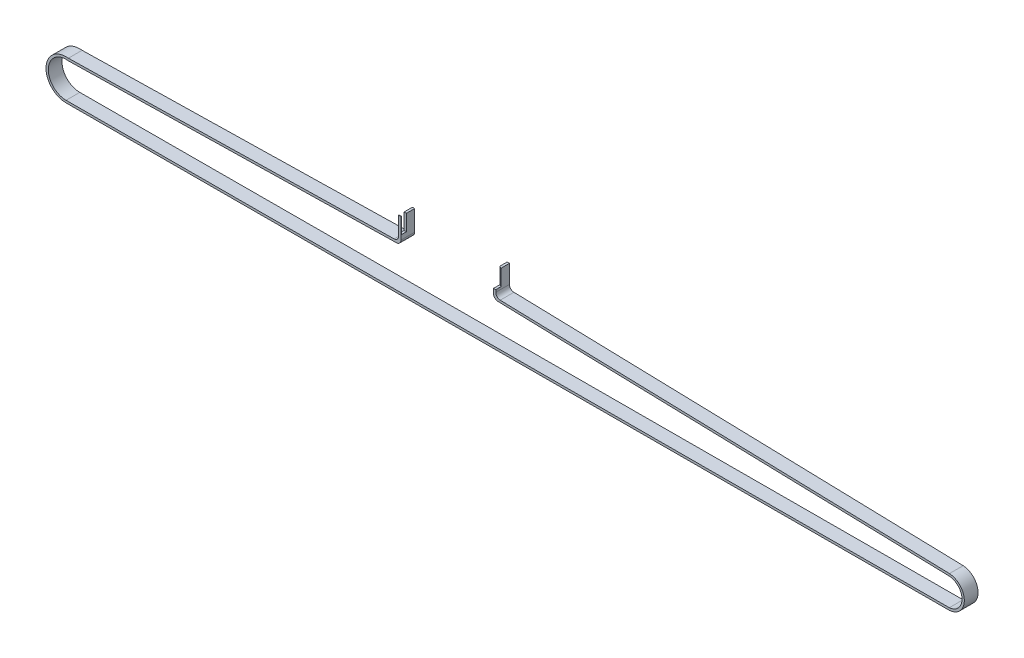
ISO-10303-21;
HEADER;
FILE_DESCRIPTION(('STEP AP214'),'2;1');
FILE_NAME('part.step','',(''),(''),'','','');
FILE_SCHEMA(('AUTOMOTIVE_DESIGN { 1 0 10303 214 1 1 1 1 }'));
ENDSEC;
DATA;
#1=APPLICATION_CONTEXT('core data for automotive mechanical design processes');
#2=APPLICATION_PROTOCOL_DEFINITION('international standard','automotive_design',2000,#1);
#3=PRODUCT_CONTEXT('',#1,'mechanical');
#4=PRODUCT('Part','Part','',(#3));
#5=PRODUCT_RELATED_PRODUCT_CATEGORY('part','',(#4));
#6=PRODUCT_DEFINITION_FORMATION('','',#4);
#7=PRODUCT_DEFINITION_CONTEXT('part definition',#1,'design');
#8=PRODUCT_DEFINITION('design','',#6,#7);
#9=PRODUCT_DEFINITION_SHAPE('','',#8);
#10=(LENGTH_UNIT() NAMED_UNIT(*) SI_UNIT(.MILLI.,.METRE.));
#11=(NAMED_UNIT(*) PLANE_ANGLE_UNIT() SI_UNIT($,.RADIAN.));
#12=(NAMED_UNIT(*) SI_UNIT($,.STERADIAN.) SOLID_ANGLE_UNIT());
#13=UNCERTAINTY_MEASURE_WITH_UNIT(LENGTH_MEASURE(1.E-05),#10,'distance_accuracy_value','');
#14=(GEOMETRIC_REPRESENTATION_CONTEXT(3) GLOBAL_UNCERTAINTY_ASSIGNED_CONTEXT((#13)) GLOBAL_UNIT_ASSIGNED_CONTEXT((#10,
#11,#12)) REPRESENTATION_CONTEXT('',''));
#15=CARTESIAN_POINT('',(0.,0.,0.));
#16=DIRECTION('',(0.,0.,1.));
#17=DIRECTION('',(1.,0.,0.));
#18=AXIS2_PLACEMENT_3D('',#15,#16,#17);
#19=CARTESIAN_POINT('',(-77.6123917073383,-109.1707684477,6.56356693467296));
#20=DIRECTION('',(0.,1.,0.));
#21=DIRECTION('',(0.,0.,1.));
#22=AXIS2_PLACEMENT_3D('',#19,#20,#21);
#23=PLANE('',#22);
#24=CARTESIAN_POINT('',(-76.3043909029961,-109.1707684477,2.20000000000011));
#25=DIRECTION('',(0.,1.,0.));
#26=DIRECTION('',(0.,0.,1.));
#27=AXIS2_PLACEMENT_3D('',#24,#25,#26);
#28=CIRCLE('',#27,2.);
#29=CARTESIAN_POINT('',(-76.6123917073383,-109.1707684477,4.17614156996025));
#30=VERTEX_POINT('',#29);
#31=CARTESIAN_POINT('',(-77.6123917073383,-109.1707684477,3.71298839910964));
#32=VERTEX_POINT('',#31);
#33=EDGE_CURVE('E19',#30,#32,#28,.F.);
#34=ORIENTED_EDGE('',*,*,#33,.F.);
#35=DIRECTION('',(0.,0.,-1.));
#36=VECTOR('',#35,1.);
#37=CARTESIAN_POINT('',(-76.6123917073383,-109.1707684477,6.56356693467296));
#38=LINE('',#37,#36);
#39=CARTESIAN_POINT('',(-76.6123917073383,-109.1707684477,0.563566934672959));
#40=VERTEX_POINT('',#39);
#41=EDGE_CURVE('E185',#40,#30,#38,.F.);
#42=ORIENTED_EDGE('',*,*,#41,.F.);
#43=DIRECTION('',(1.,0.,0.));
#44=VECTOR('',#43,1.);
#45=CARTESIAN_POINT('',(-77.6123917073383,-109.1707684477,0.563566934672959));
#46=LINE('',#45,#44);
#47=CARTESIAN_POINT('',(-77.4542112466602,-109.1707684477,0.563566934672959));
#48=VERTEX_POINT('',#47);
#49=EDGE_CURVE('E192',#40,#48,#46,.F.);
#50=ORIENTED_EDGE('',*,*,#49,.T.);
#51=CARTESIAN_POINT('',(-76.3043909029961,-109.1707684477,2.20000000000011));
#52=DIRECTION('',(0.,1.,0.));
#53=DIRECTION('',(0.,0.,1.));
#54=AXIS2_PLACEMENT_3D('',#51,#52,#53);
#55=CIRCLE('',#54,2.);
#56=CARTESIAN_POINT('',(-77.6123917073383,-109.1707684477,0.687011600890581));
#57=VERTEX_POINT('',#56);
#58=EDGE_CURVE('E206',#57,#48,#55,.F.);
#59=ORIENTED_EDGE('',*,*,#58,.F.);
#60=DIRECTION('',(0.,0.,-1.));
#61=VECTOR('',#60,1.);
#62=CARTESIAN_POINT('',(-77.6123917073383,-109.1707684477,6.56356693467296));
#63=LINE('',#62,#61);
#64=EDGE_CURVE('E188',#57,#32,#63,.F.);
#65=ORIENTED_EDGE('',*,*,#64,.T.);
#66=EDGE_LOOP('',(#34,#42,#50,#59,#65));
#67=FACE_BOUND('',#66,.T.);
#68=ADVANCED_FACE('F16',(#67),#23,.T.);
#69=CARTESIAN_POINT('',(-76.3043909029961,-116.170768447701,2.20000000000011));
#70=DIRECTION('',(0.,1.,0.));
#71=DIRECTION('',(0.,0.,1.));
#72=AXIS2_PLACEMENT_3D('',#69,#70,#71);
#73=CYLINDRICAL_SURFACE('',#72,2.);
#74=CARTESIAN_POINT('',(-76.3043909029961,-116.170768447701,2.20000000000011));
#75=DIRECTION('',(0.,1.,0.));
#76=DIRECTION('',(0.,0.,1.));
#77=AXIS2_PLACEMENT_3D('',#74,#75,#76);
#78=CIRCLE('',#77,2.);
#79=CARTESIAN_POINT('',(-76.6123917073383,-116.170768447701,4.17614156996025));
#80=VERTEX_POINT('',#79);
#81=CARTESIAN_POINT('',(-77.6123917073383,-116.170768447701,3.71298839910964));
#82=VERTEX_POINT('',#81);
#83=EDGE_CURVE('E191',#80,#82,#78,.F.);
#84=ORIENTED_EDGE('',*,*,#83,.F.);
#85=DIRECTION('',(0.,1.,0.));
#86=VECTOR('',#85,1.);
#87=CARTESIAN_POINT('',(-76.6123917073383,-120.096434525264,4.17614156996025));
#88=LINE('',#87,#86);
#89=EDGE_CURVE('E194',#30,#80,#88,.F.);
#90=ORIENTED_EDGE('',*,*,#89,.F.);
#91=ORIENTED_EDGE('',*,*,#33,.T.);
#92=DIRECTION('',(0.,1.,0.));
#93=VECTOR('',#92,1.);
#94=CARTESIAN_POINT('',(-77.6123917073383,-120.096434525264,3.71298839910964));
#95=LINE('',#94,#93);
#96=EDGE_CURVE('E267',#32,#82,#95,.F.);
#97=ORIENTED_EDGE('',*,*,#96,.T.);
#98=EDGE_LOOP('',(#84,#90,#91,#97));
#99=FACE_BOUND('',#98,.T.);
#100=ADVANCED_FACE('F195',(#99),#73,.T.);
#101=CARTESIAN_POINT('',(-76.3043909029961,-116.170768447701,2.20000000000011));
#102=DIRECTION('',(0.,1.,0.));
#103=DIRECTION('',(0.,0.,1.));
#104=AXIS2_PLACEMENT_3D('',#101,#102,#103);
#105=PLANE('',#104);
#106=DIRECTION('',(1.,0.,0.));
#107=VECTOR('',#106,1.);
#108=CARTESIAN_POINT('',(-76.3043909029961,-116.170768447701,6.56356693467296));
#109=LINE('',#108,#107);
#110=CARTESIAN_POINT('',(-77.6123917073383,-116.170768447701,6.56356693467296));
#111=VERTEX_POINT('',#110);
#112=CARTESIAN_POINT('',(-76.6123917073383,-116.170768447701,6.56356693467296));
#113=VERTEX_POINT('',#112);
#114=EDGE_CURVE('E269',#111,#113,#109,.T.);
#115=ORIENTED_EDGE('',*,*,#114,.T.);
#116=DIRECTION('',(0.,0.,-1.));
#117=VECTOR('',#116,1.);
#118=CARTESIAN_POINT('',(-76.6123917073383,-116.170768447701,6.56356693467296));
#119=LINE('',#118,#117);
#120=EDGE_CURVE('E200',#80,#113,#119,.F.);
#121=ORIENTED_EDGE('',*,*,#120,.F.);
#122=ORIENTED_EDGE('',*,*,#83,.T.);
#123=DIRECTION('',(0.,0.,-1.));
#124=VECTOR('',#123,1.);
#125=CARTESIAN_POINT('',(-77.6123917073383,-116.170768447701,6.56356693467296));
#126=LINE('',#125,#124);
#127=EDGE_CURVE('E237',#82,#111,#126,.F.);
#128=ORIENTED_EDGE('',*,*,#127,.T.);
#129=EDGE_LOOP('',(#115,#121,#122,#128));
#130=FACE_BOUND('',#129,.T.);
#131=ADVANCED_FACE('F354',(#130),#105,.T.);
#132=CARTESIAN_POINT('',(-118.921768143894,-116.170768447701,2.20000000000011));
#133=DIRECTION('',(0.,1.,0.));
#134=DIRECTION('',(0.,0.,1.));
#135=AXIS2_PLACEMENT_3D('',#132,#133,#134);
#136=CYLINDRICAL_SURFACE('',#135,4.17693228606131);
#137=CARTESIAN_POINT('',(-118.921768143894,-116.170768447701,2.20000000000011));
#138=DIRECTION('',(0.,1.,0.));
#139=DIRECTION('',(0.,0.,1.));
#140=AXIS2_PLACEMENT_3D('',#137,#138,#139);
#141=CIRCLE('',#140,4.17693228606131);
#142=CARTESIAN_POINT('',(-119.111696821927,-116.170768447701,6.37261194212965));
#143=VERTEX_POINT('',#142);
#144=CARTESIAN_POINT('',(-118.111696821927,-116.170768447701,6.2976270908501));
#145=VERTEX_POINT('',#144);
#146=EDGE_CURVE('E272',#143,#145,#141,.T.);
#147=ORIENTED_EDGE('',*,*,#146,.F.);
#148=DIRECTION('',(0.,1.,0.));
#149=VECTOR('',#148,1.);
#150=CARTESIAN_POINT('',(-119.111696821927,-120.096434525272,6.37261194212965));
#151=LINE('',#150,#149);
#152=CARTESIAN_POINT('',(-119.111696821927,-109.1707684477,6.37261194212965));
#153=VERTEX_POINT('',#152);
#154=EDGE_CURVE('E242',#153,#143,#151,.F.);
#155=ORIENTED_EDGE('',*,*,#154,.F.);
#156=CARTESIAN_POINT('',(-118.921768143894,-109.1707684477,2.20000000000011));
#157=DIRECTION('',(0.,1.,0.));
#158=DIRECTION('',(0.,0.,1.));
#159=AXIS2_PLACEMENT_3D('',#156,#157,#158);
#160=CIRCLE('',#159,4.17693228606131);
#161=CARTESIAN_POINT('',(-118.111696821927,-109.1707684477,6.2976270908501));
#162=VERTEX_POINT('',#161);
#163=EDGE_CURVE('E261',#162,#153,#160,.F.);
#164=ORIENTED_EDGE('',*,*,#163,.F.);
#165=DIRECTION('',(0.,1.,0.));
#166=VECTOR('',#165,1.);
#167=CARTESIAN_POINT('',(-118.111696821927,-120.096434525272,6.2976270908501));
#168=LINE('',#167,#166);
#169=EDGE_CURVE('E256',#162,#145,#168,.F.);
#170=ORIENTED_EDGE('',*,*,#169,.T.);
#171=EDGE_LOOP('',(#147,#155,#164,#170));
#172=FACE_BOUND('',#171,.T.);
#173=ADVANCED_FACE('F743',(#172),#136,.F.);
#174=CARTESIAN_POINT('',(-118.921768143894,-116.170768447701,2.20000000000011));
#175=DIRECTION('',(0.,1.,0.));
#176=DIRECTION('',(0.,0.,1.));
#177=AXIS2_PLACEMENT_3D('',#174,#175,#176);
#178=PLANE('',#177);
#179=DIRECTION('',(0.,0.,1.));
#180=VECTOR('',#179,1.);
#181=CARTESIAN_POINT('',(-119.111696821927,-116.170768447701,6.56356693467296));
#182=LINE('',#181,#180);
#183=CARTESIAN_POINT('',(-119.111696821927,-116.170768447701,4.1909613500169));
#184=VERTEX_POINT('',#183);
#185=EDGE_CURVE('E245',#143,#184,#182,.F.);
#186=ORIENTED_EDGE('',*,*,#185,.F.);
#187=ORIENTED_EDGE('',*,*,#146,.T.);
#188=DIRECTION('',(0.,0.,1.));
#189=VECTOR('',#188,1.);
#190=CARTESIAN_POINT('',(-118.111696821927,-116.170768447701,6.56356693467296));
#191=LINE('',#190,#189);
#192=CARTESIAN_POINT('',(-118.111696821927,-116.170768447701,4.02860177549044));
#193=VERTEX_POINT('',#192);
#194=EDGE_CURVE('E258',#145,#193,#191,.F.);
#195=ORIENTED_EDGE('',*,*,#194,.T.);
#196=CARTESIAN_POINT('',(-118.921768143894,-116.170768447701,2.20000000000011));
#197=DIRECTION('',(0.,1.,0.));
#198=DIRECTION('',(0.,0.,1.));
#199=AXIS2_PLACEMENT_3D('',#196,#197,#198);
#200=CIRCLE('',#199,2.);
#201=EDGE_CURVE('E348',#184,#193,#200,.T.);
#202=ORIENTED_EDGE('',*,*,#201,.F.);
#203=EDGE_LOOP('',(#186,#187,#195,#202));
#204=FACE_BOUND('',#203,.T.);
#205=ADVANCED_FACE('F734',(#204),#178,.T.);
#206=CARTESIAN_POINT('',(-118.921768143894,-116.170768447701,2.20000000000011));
#207=DIRECTION('',(0.,1.,0.));
#208=DIRECTION('',(0.,0.,1.));
#209=AXIS2_PLACEMENT_3D('',#206,#207,#208);
#210=CYLINDRICAL_SURFACE('',#209,2.);
#211=CARTESIAN_POINT('',(-118.921768143894,-109.1707684477,2.20000000000011));
#212=DIRECTION('',(0.,1.,0.));
#213=DIRECTION('',(0.,0.,1.));
#214=AXIS2_PLACEMENT_3D('',#211,#212,#213);
#215=CIRCLE('',#214,2.);
#216=CARTESIAN_POINT('',(-119.111696821927,-109.1707684477,4.1909613500169));
#217=VERTEX_POINT('',#216);
#218=CARTESIAN_POINT('',(-118.111696821927,-109.1707684477,4.02860177549044));
#219=VERTEX_POINT('',#218);
#220=EDGE_CURVE('E251',#217,#219,#215,.T.);
#221=ORIENTED_EDGE('',*,*,#220,.F.);
#222=DIRECTION('',(0.,1.,0.));
#223=VECTOR('',#222,1.);
#224=CARTESIAN_POINT('',(-119.111696821927,-120.096434525272,4.1909613500169));
#225=LINE('',#224,#223);
#226=EDGE_CURVE('E223',#184,#217,#225,.T.);
#227=ORIENTED_EDGE('',*,*,#226,.F.);
#228=ORIENTED_EDGE('',*,*,#201,.T.);
#229=DIRECTION('',(0.,1.,0.));
#230=VECTOR('',#229,1.);
#231=CARTESIAN_POINT('',(-118.111696821927,-120.096434525272,4.02860177549044));
#232=LINE('',#231,#230);
#233=EDGE_CURVE('E230',#193,#219,#232,.T.);
#234=ORIENTED_EDGE('',*,*,#233,.T.);
#235=EDGE_LOOP('',(#221,#227,#228,#234));
#236=FACE_BOUND('',#235,.T.);
#237=ADVANCED_FACE('F725',(#236),#210,.T.);
#238=CARTESIAN_POINT('',(-119.111696821927,-109.1707684477,6.56356693467296));
#239=DIRECTION('',(0.,1.,0.));
#240=DIRECTION('',(0.,0.,1.));
#241=AXIS2_PLACEMENT_3D('',#238,#239,#240);
#242=PLANE('',#241);
#243=DIRECTION('',(0.,0.,1.));
#244=VECTOR('',#243,1.);
#245=CARTESIAN_POINT('',(-118.111696821927,-109.1707684477,6.56356693467296));
#246=LINE('',#245,#244);
#247=CARTESIAN_POINT('',(-118.111696821927,-109.1707684477,0.563566934672959));
#248=VERTEX_POINT('',#247);
#249=EDGE_CURVE('E226',#219,#248,#246,.F.);
#250=ORIENTED_EDGE('',*,*,#249,.T.);
#251=DIRECTION('',(1.,0.,0.));
#252=VECTOR('',#251,1.);
#253=CARTESIAN_POINT('',(-119.111696821927,-109.1707684477,0.563566934672959));
#254=LINE('',#253,#252);
#255=CARTESIAN_POINT('',(-119.111696821927,-109.1707684477,0.563566934672959));
#256=VERTEX_POINT('',#255);
#257=EDGE_CURVE('E201',#248,#256,#254,.F.);
#258=ORIENTED_EDGE('',*,*,#257,.T.);
#259=DIRECTION('',(0.,0.,1.));
#260=VECTOR('',#259,1.);
#261=CARTESIAN_POINT('',(-119.111696821927,-109.1707684477,6.56356693467296));
#262=LINE('',#261,#260);
#263=EDGE_CURVE('E219',#217,#256,#262,.F.);
#264=ORIENTED_EDGE('',*,*,#263,.F.);
#265=ORIENTED_EDGE('',*,*,#220,.T.);
#266=EDGE_LOOP('',(#250,#258,#264,#265));
#267=FACE_BOUND('',#266,.T.);
#268=ADVANCED_FACE('F511',(#267),#242,.T.);
#269=CARTESIAN_POINT('',(-76.6123917073383,-120.096434525264,6.56356693467296));
#270=DIRECTION('',(1.,0.,0.));
#271=DIRECTION('',(0.,0.,-1.));
#272=AXIS2_PLACEMENT_3D('',#269,#270,#271);
#273=PLANE('',#272);
#274=DIRECTION('',(0.,1.,0.));
#275=VECTOR('',#274,1.);
#276=CARTESIAN_POINT('',(-76.6123917073383,-130.657156953866,0.563566934672959));
#277=LINE('',#276,#275);
#278=CARTESIAN_POINT('',(-76.6123917073383,-117.176487603258,0.563566934672959));
#279=VERTEX_POINT('',#278);
#280=EDGE_CURVE('E205',#279,#40,#277,.T.);
#281=ORIENTED_EDGE('',*,*,#280,.T.);
#282=ORIENTED_EDGE('',*,*,#41,.T.);
#283=ORIENTED_EDGE('',*,*,#89,.T.);
#284=ORIENTED_EDGE('',*,*,#120,.T.);
#285=DIRECTION('',(0.,1.,0.));
#286=VECTOR('',#285,1.);
#287=CARTESIAN_POINT('',(-76.6123917073383,-120.096434525264,6.56356693467296));
#288=LINE('',#287,#286);
#289=CARTESIAN_POINT('',(-76.6123917073383,-117.176487603258,6.56356693467296));
#290=VERTEX_POINT('',#289);
#291=EDGE_CURVE('E207',#113,#290,#288,.F.);
#292=ORIENTED_EDGE('',*,*,#291,.T.);
#293=DIRECTION('',(0.,0.,1.));
#294=VECTOR('',#293,1.);
#295=CARTESIAN_POINT('',(-76.6123917073383,-117.176487603258,6.56356693467296));
#296=LINE('',#295,#294);
#297=EDGE_CURVE('E391',#290,#279,#296,.F.);
#298=ORIENTED_EDGE('',*,*,#297,.T.);
#299=EDGE_LOOP('',(#281,#282,#283,#284,#292,#298));
#300=FACE_BOUND('',#299,.T.);
#301=ADVANCED_FACE('F203',(#300),#273,.T.);
#302=CARTESIAN_POINT('',(-76.3043909029961,-116.170768447701,2.20000000000011));
#303=DIRECTION('',(0.,1.,0.));
#304=DIRECTION('',(0.,0.,1.));
#305=AXIS2_PLACEMENT_3D('',#302,#303,#304);
#306=CYLINDRICAL_SURFACE('',#305,2.);
#307=DIRECTION('',(0.,1.,0.));
#308=VECTOR('',#307,1.);
#309=CARTESIAN_POINT('',(-77.4542112466602,-130.657156953866,0.563566934672959));
#310=LINE('',#309,#308);
#311=CARTESIAN_POINT('',(-77.4542112466602,-116.170768447701,0.563566934672959));
#312=VERTEX_POINT('',#311);
#313=EDGE_CURVE('E365',#48,#312,#310,.F.);
#314=ORIENTED_EDGE('',*,*,#313,.T.);
#315=CARTESIAN_POINT('',(-76.3043909029961,-116.170768447701,2.20000000000011));
#316=DIRECTION('',(0.,1.,0.));
#317=DIRECTION('',(0.,0.,1.));
#318=AXIS2_PLACEMENT_3D('',#315,#316,#317);
#319=CIRCLE('',#318,2.);
#320=CARTESIAN_POINT('',(-77.6123917073383,-116.170768447701,0.687011600890581));
#321=VERTEX_POINT('',#320);
#322=EDGE_CURVE('E210',#321,#312,#319,.F.);
#323=ORIENTED_EDGE('',*,*,#322,.F.);
#324=DIRECTION('',(0.,1.,0.));
#325=VECTOR('',#324,1.);
#326=CARTESIAN_POINT('',(-77.6123917073383,-120.096434525264,0.687011600890582));
#327=LINE('',#326,#325);
#328=EDGE_CURVE('E264',#321,#57,#327,.T.);
#329=ORIENTED_EDGE('',*,*,#328,.T.);
#330=ORIENTED_EDGE('',*,*,#58,.T.);
#331=EDGE_LOOP('',(#314,#323,#329,#330));
#332=FACE_BOUND('',#331,.T.);
#333=ADVANCED_FACE('F502',(#332),#306,.T.);
#334=CARTESIAN_POINT('',(-76.3043909029961,-116.170768447701,2.20000000000011));
#335=DIRECTION('',(0.,1.,0.));
#336=DIRECTION('',(0.,0.,1.));
#337=AXIS2_PLACEMENT_3D('',#334,#335,#336);
#338=PLANE('',#337);
#339=ORIENTED_EDGE('',*,*,#322,.T.);
#340=DIRECTION('',(1.,0.,0.));
#341=VECTOR('',#340,1.);
#342=CARTESIAN_POINT('',(-264.648815476265,-116.170768447701,0.563566934672959));
#343=LINE('',#342,#341);
#344=CARTESIAN_POINT('',(-77.6123917073383,-116.170768447701,0.563566934672959));
#345=VERTEX_POINT('',#344);
#346=EDGE_CURVE('E320',#312,#345,#343,.F.);
#347=ORIENTED_EDGE('',*,*,#346,.T.);
#348=DIRECTION('',(0.,0.,-1.));
#349=VECTOR('',#348,1.);
#350=CARTESIAN_POINT('',(-77.6123917073383,-116.170768447701,6.56356693467296));
#351=LINE('',#350,#349);
#352=EDGE_CURVE('E233',#345,#321,#351,.F.);
#353=ORIENTED_EDGE('',*,*,#352,.T.);
#354=EDGE_LOOP('',(#339,#347,#353));
#355=FACE_BOUND('',#354,.T.);
#356=ADVANCED_FACE('F370',(#355),#338,.T.);
#357=CARTESIAN_POINT('',(-77.6123917073383,-120.096434525264,6.56356693467296));
#358=DIRECTION('',(1.,0.,0.));
#359=DIRECTION('',(0.,0.,-1.));
#360=AXIS2_PLACEMENT_3D('',#357,#358,#359);
#361=PLANE('',#360);
#362=DIRECTION('',(0.,1.,0.));
#363=VECTOR('',#362,1.);
#364=CARTESIAN_POINT('',(-77.6123917073383,-130.657156953866,0.563566934672959));
#365=LINE('',#364,#363);
#366=CARTESIAN_POINT('',(-77.6123917073383,-118.149803243927,0.563566934672959));
#367=VERTEX_POINT('',#366);
#368=EDGE_CURVE('E341',#345,#367,#365,.F.);
#369=ORIENTED_EDGE('',*,*,#368,.T.);
#370=DIRECTION('',(0.,0.,-1.));
#371=VECTOR('',#370,1.);
#372=CARTESIAN_POINT('',(-77.6123917073383,-118.149803243927,6.56356693467296));
#373=LINE('',#372,#371);
#374=CARTESIAN_POINT('',(-77.6123917073383,-118.149803243927,6.56356693467296));
#375=VERTEX_POINT('',#374);
#376=EDGE_CURVE('E236',#375,#367,#373,.T.);
#377=ORIENTED_EDGE('',*,*,#376,.F.);
#378=DIRECTION('',(0.,1.,0.));
#379=VECTOR('',#378,1.);
#380=CARTESIAN_POINT('',(-77.6123917073383,-130.657156953866,6.56356693467296));
#381=LINE('',#380,#379);
#382=EDGE_CURVE('E315',#111,#375,#381,.F.);
#383=ORIENTED_EDGE('',*,*,#382,.F.);
#384=ORIENTED_EDGE('',*,*,#127,.F.);
#385=ORIENTED_EDGE('',*,*,#96,.F.);
#386=ORIENTED_EDGE('',*,*,#64,.F.);
#387=ORIENTED_EDGE('',*,*,#328,.F.);
#388=ORIENTED_EDGE('',*,*,#352,.F.);
#389=EDGE_LOOP('',(#369,#377,#383,#384,#385,#386,#387,#388));
#390=FACE_BOUND('',#389,.T.);
#391=ADVANCED_FACE('F357',(#390),#361,.F.);
#392=CARTESIAN_POINT('',(-75.6123917073383,-118.149803243927,6.56356693467296));
#393=DIRECTION('',(0.,0.,-1.));
#394=DIRECTION('',(-1.,0.,0.));
#395=AXIS2_PLACEMENT_3D('',#392,#393,#394);
#396=CYLINDRICAL_SURFACE('',#395,2.);
#397=CARTESIAN_POINT('',(-75.6123917073383,-118.149803243927,0.563566934672959));
#398=DIRECTION('',(0.,0.,-1.));
#399=DIRECTION('',(-1.,0.,0.));
#400=AXIS2_PLACEMENT_3D('',#397,#398,#399);
#401=CIRCLE('',#400,2.);
#402=CARTESIAN_POINT('',(-75.666472220668,-120.149071934743,0.563566934672958));
#403=VERTEX_POINT('',#402);
#404=EDGE_CURVE('E339',#367,#403,#401,.F.);
#405=ORIENTED_EDGE('',*,*,#404,.T.);
#406=DIRECTION('',(0.,0.,1.));
#407=VECTOR('',#406,1.);
#408=CARTESIAN_POINT('',(-75.666472220668,-120.149071934743,6.56356693467296));
#409=LINE('',#408,#407);
#410=CARTESIAN_POINT('',(-75.666472220668,-120.149071934743,6.56356693467296));
#411=VERTEX_POINT('',#410);
#412=EDGE_CURVE('E423',#403,#411,#409,.T.);
#413=ORIENTED_EDGE('',*,*,#412,.T.);
#414=CARTESIAN_POINT('',(-75.6123917073383,-118.149803243927,6.56356693467296));
#415=DIRECTION('',(0.,0.,-1.));
#416=DIRECTION('',(-1.,0.,0.));
#417=AXIS2_PLACEMENT_3D('',#414,#415,#416);
#418=CIRCLE('',#417,2.);
#419=EDGE_CURVE('E312',#375,#411,#418,.F.);
#420=ORIENTED_EDGE('',*,*,#419,.F.);
#421=ORIENTED_EDGE('',*,*,#376,.T.);
#422=EDGE_LOOP('',(#405,#413,#420,#421));
#423=FACE_BOUND('',#422,.T.);
#424=ADVANCED_FACE('F428',(#423),#396,.T.);
#425=CARTESIAN_POINT('',(121.836852943332,-125.491566046838,6.56356693467296));
#426=DIRECTION('',(0.0270402566648223,0.99963434540811,0.));
#427=DIRECTION('',(-0.99963434540811,0.0270402566648223,0.));
#428=AXIS2_PLACEMENT_3D('',#425,#426,#427);
#429=PLANE('',#428);
#430=ORIENTED_EDGE('',*,*,#412,.F.);
#431=DIRECTION('',(0.99963434540811,-0.0270402566648222,0.));
#432=VECTOR('',#431,1.);
#433=CARTESIAN_POINT('',(-75.666472220668,-120.149071934743,0.563566934672959));
#434=LINE('',#433,#432);
#435=CARTESIAN_POINT('',(121.836852943332,-125.491566046838,0.563566934672959));
#436=VERTEX_POINT('',#435);
#437=EDGE_CURVE('E338',#403,#436,#434,.T.);
#438=ORIENTED_EDGE('',*,*,#437,.T.);
#439=DIRECTION('',(0.,0.,-1.));
#440=VECTOR('',#439,1.);
#441=CARTESIAN_POINT('',(121.836852943332,-125.491566046838,6.56356693467296));
#442=LINE('',#441,#440);
#443=CARTESIAN_POINT('',(121.836852943332,-125.491566046838,6.56356693467296));
#444=VERTEX_POINT('',#443);
#445=EDGE_CURVE('E422',#436,#444,#442,.F.);
#446=ORIENTED_EDGE('',*,*,#445,.T.);
#447=DIRECTION('',(0.99963434540811,-0.0270402566648222,0.));
#448=VECTOR('',#447,1.);
#449=CARTESIAN_POINT('',(-75.666472220668,-120.149071934743,6.56356693467296));
#450=LINE('',#449,#448);
#451=EDGE_CURVE('E311',#411,#444,#450,.T.);
#452=ORIENTED_EDGE('',*,*,#451,.F.);
#453=EDGE_LOOP('',(#430,#438,#446,#452));
#454=FACE_BOUND('',#453,.T.);
#455=ADVANCED_FACE('F571',(#454),#429,.F.);
#456=CARTESIAN_POINT('',(121.394517857936,-131.470824001945,6.56356693467296));
#457=DIRECTION('',(0.,0.,-1.));
#458=DIRECTION('',(-1.,0.,0.));
#459=AXIS2_PLACEMENT_3D('',#456,#457,#458);
#460=CYLINDRICAL_SURFACE('',#459,5.99559721975081);
#461=DIRECTION('',(0.,0.,1.));
#462=VECTOR('',#461,1.);
#463=CARTESIAN_POINT('',(121.825156451343,-137.450935741984,6.56356693467296));
#464=LINE('',#463,#462);
#465=CARTESIAN_POINT('',(121.825156451343,-137.450935741984,0.563566934672958));
#466=VERTEX_POINT('',#465);
#467=CARTESIAN_POINT('',(121.825156451343,-137.450935741984,6.56356693467296));
#468=VERTEX_POINT('',#467);
#469=EDGE_CURVE('E420',#466,#468,#464,.T.);
#470=ORIENTED_EDGE('',*,*,#469,.T.);
#471=CARTESIAN_POINT('',(121.394517857936,-131.470824001945,6.56356693467296));
#472=DIRECTION('',(0.,0.,-1.));
#473=DIRECTION('',(-1.,0.,0.));
#474=AXIS2_PLACEMENT_3D('',#471,#472,#473);
#475=CIRCLE('',#474,5.99559721975081);
#476=EDGE_CURVE('E308',#444,#468,#475,.T.);
#477=ORIENTED_EDGE('',*,*,#476,.F.);
#478=ORIENTED_EDGE('',*,*,#445,.F.);
#479=CARTESIAN_POINT('',(121.394517857936,-131.470824001945,0.563566934672959));
#480=DIRECTION('',(0.,0.,-1.));
#481=DIRECTION('',(-1.,0.,0.));
#482=AXIS2_PLACEMENT_3D('',#479,#480,#481);
#483=CIRCLE('',#482,5.99559721975081);
#484=EDGE_CURVE('E336',#436,#466,#483,.T.);
#485=ORIENTED_EDGE('',*,*,#484,.T.);
#486=EDGE_LOOP('',(#470,#477,#478,#485));
#487=FACE_BOUND('',#486,.T.);
#488=ADVANCED_FACE('F568',(#487),#460,.F.);
#489=CARTESIAN_POINT('',(-264.629528335664,-138.412080698056,6.56356693467296));
#490=DIRECTION('',(0.00248707551312212,-0.999996907222913,0.));
#491=DIRECTION('',(0.999996907222913,0.00248707551312212,0.));
#492=AXIS2_PLACEMENT_3D('',#489,#490,#491);
#493=PLANE('',#492);
#494=DIRECTION('',(0.,0.,-1.));
#495=VECTOR('',#494,1.);
#496=CARTESIAN_POINT('',(-264.629528335664,-138.412080698056,6.56356693467296));
#497=LINE('',#496,#495);
#498=CARTESIAN_POINT('',(-264.629528335664,-138.412080698056,0.563566934672959));
#499=VERTEX_POINT('',#498);
#500=CARTESIAN_POINT('',(-264.629528335664,-138.412080698056,6.56356693467296));
#501=VERTEX_POINT('',#500);
#502=EDGE_CURVE('E417',#499,#501,#497,.F.);
#503=ORIENTED_EDGE('',*,*,#502,.T.);
#504=DIRECTION('',(-0.999996907222913,-0.00248707551312205,0.));
#505=VECTOR('',#504,1.);
#506=CARTESIAN_POINT('',(121.825156451343,-137.450935741984,6.56356693467296));
#507=LINE('',#506,#505);
#508=EDGE_CURVE('E307',#468,#501,#507,.T.);
#509=ORIENTED_EDGE('',*,*,#508,.F.);
#510=ORIENTED_EDGE('',*,*,#469,.F.);
#511=DIRECTION('',(-0.999996907222913,-0.00248707551312205,0.));
#512=VECTOR('',#511,1.);
#513=CARTESIAN_POINT('',(121.825156451343,-137.450935741984,0.563566934672959));
#514=LINE('',#513,#512);
#515=EDGE_CURVE('E335',#466,#499,#514,.T.);
#516=ORIENTED_EDGE('',*,*,#515,.T.);
#517=EDGE_LOOP('',(#503,#509,#510,#516));
#518=FACE_BOUND('',#517,.T.);
#519=ADVANCED_FACE('F465',(#518),#493,.F.);
#520=CARTESIAN_POINT('',(-264.648815476265,-130.657156953866,6.56356693467296));
#521=DIRECTION('',(0.,0.,-1.));
#522=DIRECTION('',(-1.,0.,0.));
#523=AXIS2_PLACEMENT_3D('',#520,#521,#522);
#524=CYLINDRICAL_SURFACE('',#523,7.75494772851443);
#525=CARTESIAN_POINT('',(-264.648815476265,-130.657156953866,6.56356693467296));
#526=DIRECTION('',(0.,0.,-1.));
#527=DIRECTION('',(-1.,0.,0.));
#528=AXIS2_PLACEMENT_3D('',#525,#526,#527);
#529=CIRCLE('',#528,7.75494772851443);
#530=CARTESIAN_POINT('',(-263.662284962799,-122.965214948235,6.56356693467296));
#531=VERTEX_POINT('',#530);
#532=EDGE_CURVE('E304',#501,#531,#529,.T.);
#533=ORIENTED_EDGE('',*,*,#532,.F.);
#534=ORIENTED_EDGE('',*,*,#502,.F.);
#535=CARTESIAN_POINT('',(-264.648815476265,-130.657156953866,0.563566934672959));
#536=DIRECTION('',(0.,0.,-1.));
#537=DIRECTION('',(-1.,0.,0.));
#538=AXIS2_PLACEMENT_3D('',#535,#536,#537);
#539=CIRCLE('',#538,7.75494772851443);
#540=CARTESIAN_POINT('',(-263.662284962799,-122.965214948235,0.563566934672958));
#541=VERTEX_POINT('',#540);
#542=EDGE_CURVE('E333',#499,#541,#539,.T.);
#543=ORIENTED_EDGE('',*,*,#542,.T.);
#544=DIRECTION('',(0.,0.,1.));
#545=VECTOR('',#544,1.);
#546=CARTESIAN_POINT('',(-263.662284962799,-122.965214948235,6.56356693467296));
#547=LINE('',#546,#545);
#548=EDGE_CURVE('E415',#541,#531,#547,.T.);
#549=ORIENTED_EDGE('',*,*,#548,.T.);
#550=EDGE_LOOP('',(#533,#534,#543,#549));
#551=FACE_BOUND('',#550,.T.);
#552=ADVANCED_FACE('F470',(#551),#524,.F.);
#553=CARTESIAN_POINT('',(-263.662284962799,-122.965214948235,6.56356693467296));
#554=DIRECTION('',(-0.0197060238129421,0.999805817459312,0.));
#555=DIRECTION('',(-0.999805817459312,-0.0197060238129421,0.));
#556=AXIS2_PLACEMENT_3D('',#553,#554,#555);
#557=PLANE('',#556);
#558=DIRECTION('',(0.,0.,-1.));
#559=VECTOR('',#558,1.);
#560=CARTESIAN_POINT('',(-120.072284774301,-120.135077421925,6.56356693467296));
#561=LINE('',#560,#559);
#562=CARTESIAN_POINT('',(-120.072284774301,-120.135077421925,6.56356693467296));
#563=VERTEX_POINT('',#562);
#564=CARTESIAN_POINT('',(-120.072284774301,-120.135077421925,0.563566934672959));
#565=VERTEX_POINT('',#564);
#566=EDGE_CURVE('E263',#563,#565,#561,.T.);
#567=ORIENTED_EDGE('',*,*,#566,.F.);
#568=DIRECTION('',(0.999805817459312,0.0197060238129421,0.));
#569=VECTOR('',#568,1.);
#570=CARTESIAN_POINT('',(-263.662284962799,-122.965214948235,6.56356693467296));
#571=LINE('',#570,#569);
#572=EDGE_CURVE('E303',#531,#563,#571,.T.);
#573=ORIENTED_EDGE('',*,*,#572,.F.);
#574=ORIENTED_EDGE('',*,*,#548,.F.);
#575=DIRECTION('',(0.999805817459312,0.0197060238129421,0.));
#576=VECTOR('',#575,1.);
#577=CARTESIAN_POINT('',(-263.662284962799,-122.965214948235,0.563566934672959));
#578=LINE('',#577,#576);
#579=EDGE_CURVE('E332',#541,#565,#578,.T.);
#580=ORIENTED_EDGE('',*,*,#579,.T.);
#581=EDGE_LOOP('',(#567,#573,#574,#580));
#582=FACE_BOUND('',#581,.T.);
#583=ADVANCED_FACE('F559',(#582),#557,.F.);
#584=CARTESIAN_POINT('',(-120.111696821927,-118.135465787006,6.56356693467296));
#585=DIRECTION('',(0.,0.,-1.));
#586=DIRECTION('',(-1.,0.,0.));
#587=AXIS2_PLACEMENT_3D('',#584,#585,#586);
#588=CYLINDRICAL_SURFACE('',#587,2.);
#589=CARTESIAN_POINT('',(-120.111696821927,-118.135465787006,0.563566934672959));
#590=DIRECTION('',(0.,0.,-1.));
#591=DIRECTION('',(-1.,0.,0.));
#592=AXIS2_PLACEMENT_3D('',#589,#590,#591);
#593=CIRCLE('',#592,2.);
#594=CARTESIAN_POINT('',(-118.111696821927,-118.135465787006,0.563566934672959));
#595=VERTEX_POINT('',#594);
#596=EDGE_CURVE('E329',#565,#595,#593,.F.);
#597=ORIENTED_EDGE('',*,*,#596,.T.);
#598=DIRECTION('',(0.,0.,1.));
#599=VECTOR('',#598,1.);
#600=CARTESIAN_POINT('',(-118.111696821927,-118.135465787006,6.56356693467296));
#601=LINE('',#600,#599);
#602=CARTESIAN_POINT('',(-118.111696821927,-118.135465787006,6.56356693467296));
#603=VERTEX_POINT('',#602);
#604=EDGE_CURVE('E229',#595,#603,#601,.T.);
#605=ORIENTED_EDGE('',*,*,#604,.T.);
#606=CARTESIAN_POINT('',(-120.111696821927,-118.135465787006,6.56356693467296));
#607=DIRECTION('',(0.,0.,-1.));
#608=DIRECTION('',(-1.,0.,0.));
#609=AXIS2_PLACEMENT_3D('',#606,#607,#608);
#610=CIRCLE('',#609,2.);
#611=EDGE_CURVE('E299',#563,#603,#610,.F.);
#612=ORIENTED_EDGE('',*,*,#611,.F.);
#613=ORIENTED_EDGE('',*,*,#566,.T.);
#614=EDGE_LOOP('',(#597,#605,#612,#613));
#615=FACE_BOUND('',#614,.T.);
#616=ADVANCED_FACE('F555',(#615),#588,.T.);
#617=CARTESIAN_POINT('',(-118.111696821927,-120.096434525272,6.56356693467296));
#618=DIRECTION('',(-1.,0.,0.));
#619=DIRECTION('',(0.,0.,1.));
#620=AXIS2_PLACEMENT_3D('',#617,#618,#619);
#621=PLANE('',#620);
#622=ORIENTED_EDGE('',*,*,#169,.F.);
#623=DIRECTION('',(0.,0.,1.));
#624=VECTOR('',#623,1.);
#625=CARTESIAN_POINT('',(-118.111696821927,-109.1707684477,6.56356693467296));
#626=LINE('',#625,#624);
#627=CARTESIAN_POINT('',(-118.111696821927,-109.1707684477,6.56356693467296));
#628=VERTEX_POINT('',#627);
#629=EDGE_CURVE('E246',#628,#162,#626,.F.);
#630=ORIENTED_EDGE('',*,*,#629,.F.);
#631=DIRECTION('',(0.,1.,0.));
#632=VECTOR('',#631,1.);
#633=CARTESIAN_POINT('',(-118.111696821927,-130.657156953866,6.56356693467296));
#634=LINE('',#633,#632);
#635=EDGE_CURVE('E302',#603,#628,#634,.T.);
#636=ORIENTED_EDGE('',*,*,#635,.F.);
#637=ORIENTED_EDGE('',*,*,#604,.F.);
#638=DIRECTION('',(0.,1.,0.));
#639=VECTOR('',#638,1.);
#640=CARTESIAN_POINT('',(-118.111696821927,-130.657156953866,0.563566934672959));
#641=LINE('',#640,#639);
#642=EDGE_CURVE('E331',#595,#248,#641,.T.);
#643=ORIENTED_EDGE('',*,*,#642,.T.);
#644=ORIENTED_EDGE('',*,*,#249,.F.);
#645=ORIENTED_EDGE('',*,*,#233,.F.);
#646=ORIENTED_EDGE('',*,*,#194,.F.);
#647=EDGE_LOOP('',(#622,#630,#636,#637,#643,#644,#645,#646));
#648=FACE_BOUND('',#647,.T.);
#649=ADVANCED_FACE('F551',(#648),#621,.F.);
#650=CARTESIAN_POINT('',(-119.111696821927,-109.1707684477,6.56356693467296));
#651=DIRECTION('',(0.,1.,0.));
#652=DIRECTION('',(0.,0.,1.));
#653=AXIS2_PLACEMENT_3D('',#650,#651,#652);
#654=PLANE('',#653);
#655=ORIENTED_EDGE('',*,*,#629,.T.);
#656=ORIENTED_EDGE('',*,*,#163,.T.);
#657=DIRECTION('',(0.,0.,1.));
#658=VECTOR('',#657,1.);
#659=CARTESIAN_POINT('',(-119.111696821927,-109.1707684477,6.56356693467296));
#660=LINE('',#659,#658);
#661=CARTESIAN_POINT('',(-119.111696821927,-109.1707684477,6.56356693467296));
#662=VERTEX_POINT('',#661);
#663=EDGE_CURVE('E222',#662,#153,#660,.F.);
#664=ORIENTED_EDGE('',*,*,#663,.F.);
#665=DIRECTION('',(1.,0.,0.));
#666=VECTOR('',#665,1.);
#667=CARTESIAN_POINT('',(-264.648815476265,-109.1707684477,6.56356693467296));
#668=LINE('',#667,#666);
#669=EDGE_CURVE('E403',#628,#662,#668,.F.);
#670=ORIENTED_EDGE('',*,*,#669,.F.);
#671=EDGE_LOOP('',(#655,#656,#664,#670));
#672=FACE_BOUND('',#671,.T.);
#673=ADVANCED_FACE('F547',(#672),#654,.T.);
#674=CARTESIAN_POINT('',(-119.111696821927,-120.096434525272,6.56356693467296));
#675=DIRECTION('',(-1.,0.,0.));
#676=DIRECTION('',(0.,0.,1.));
#677=AXIS2_PLACEMENT_3D('',#674,#675,#676);
#678=PLANE('',#677);
#679=DIRECTION('',(0.,1.,0.));
#680=VECTOR('',#679,1.);
#681=CARTESIAN_POINT('',(-119.111696821927,-130.657156953866,6.56356693467296));
#682=LINE('',#681,#680);
#683=CARTESIAN_POINT('',(-119.111696821927,-117.154981417873,6.56356693467296));
#684=VERTEX_POINT('',#683);
#685=EDGE_CURVE('E298',#662,#684,#682,.F.);
#686=ORIENTED_EDGE('',*,*,#685,.F.);
#687=ORIENTED_EDGE('',*,*,#663,.T.);
#688=ORIENTED_EDGE('',*,*,#154,.T.);
#689=ORIENTED_EDGE('',*,*,#185,.T.);
#690=ORIENTED_EDGE('',*,*,#226,.T.);
#691=ORIENTED_EDGE('',*,*,#263,.T.);
#692=DIRECTION('',(0.,1.,0.));
#693=VECTOR('',#692,1.);
#694=CARTESIAN_POINT('',(-119.111696821927,-130.657156953866,0.563566934672959));
#695=LINE('',#694,#693);
#696=CARTESIAN_POINT('',(-119.111696821927,-117.154981417873,0.563566934672959));
#697=VERTEX_POINT('',#696);
#698=EDGE_CURVE('E328',#256,#697,#695,.F.);
#699=ORIENTED_EDGE('',*,*,#698,.T.);
#700=DIRECTION('',(0.,0.,1.));
#701=VECTOR('',#700,1.);
#702=CARTESIAN_POINT('',(-119.111696821927,-117.154981417873,6.56356693467296));
#703=LINE('',#702,#701);
#704=EDGE_CURVE('E397',#697,#684,#703,.T.);
#705=ORIENTED_EDGE('',*,*,#704,.T.);
#706=EDGE_LOOP('',(#686,#687,#688,#689,#690,#691,#699,#705));
#707=FACE_BOUND('',#706,.T.);
#708=ADVANCED_FACE('F543',(#707),#678,.T.);
#709=CARTESIAN_POINT('',(-121.111696821927,-117.154981417873,6.56356693467296));
#710=DIRECTION('',(0.,0.,1.));
#711=DIRECTION('',(1.,0.,0.));
#712=AXIS2_PLACEMENT_3D('',#709,#710,#711);
#713=CYLINDRICAL_SURFACE('',#712,2.);
#714=ORIENTED_EDGE('',*,*,#704,.F.);
#715=CARTESIAN_POINT('',(-121.111696821927,-117.154981417873,0.563566934672959));
#716=DIRECTION('',(0.,0.,1.));
#717=DIRECTION('',(1.,0.,0.));
#718=AXIS2_PLACEMENT_3D('',#715,#716,#717);
#719=CIRCLE('',#718,2.);
#720=CARTESIAN_POINT('',(-121.072284774301,-119.154593052792,0.563566934672959));
#721=VERTEX_POINT('',#720);
#722=EDGE_CURVE('E325',#697,#721,#719,.F.);
#723=ORIENTED_EDGE('',*,*,#722,.T.);
#724=DIRECTION('',(0.,0.,1.));
#725=VECTOR('',#724,1.);
#726=CARTESIAN_POINT('',(-121.072284774301,-119.154593052792,6.56356693467296));
#727=LINE('',#726,#725);
#728=CARTESIAN_POINT('',(-121.072284774301,-119.154593052792,6.56356693467296));
#729=VERTEX_POINT('',#728);
#730=EDGE_CURVE('E393',#729,#721,#727,.F.);
#731=ORIENTED_EDGE('',*,*,#730,.F.);
#732=CARTESIAN_POINT('',(-121.111696821927,-117.154981417873,6.56356693467296));
#733=DIRECTION('',(0.,0.,1.));
#734=DIRECTION('',(1.,0.,0.));
#735=AXIS2_PLACEMENT_3D('',#732,#733,#734);
#736=CIRCLE('',#735,2.);
#737=EDGE_CURVE('E295',#684,#729,#736,.F.);
#738=ORIENTED_EDGE('',*,*,#737,.F.);
#739=EDGE_LOOP('',(#714,#723,#731,#738));
#740=FACE_BOUND('',#739,.T.);
#741=ADVANCED_FACE('F539',(#740),#713,.F.);
#742=CARTESIAN_POINT('',(-263.681990986612,-121.965409130776,6.56356693467296));
#743=DIRECTION('',(-0.0197060238129421,0.999805817459312,0.));
#744=DIRECTION('',(-0.999805817459312,-0.0197060238129421,0.));
#745=AXIS2_PLACEMENT_3D('',#742,#743,#744);
#746=PLANE('',#745);
#747=DIRECTION('',(-0.999805817459312,-0.0197060238129421,0.));
#748=VECTOR('',#747,1.);
#749=CARTESIAN_POINT('',(-121.072284774301,-119.154593052792,0.563566934672959));
#750=LINE('',#749,#748);
#751=CARTESIAN_POINT('',(-263.610486022413,-121.963999778577,0.563566934672959));
#752=VERTEX_POINT('',#751);
#753=EDGE_CURVE('E327',#721,#752,#750,.T.);
#754=ORIENTED_EDGE('',*,*,#753,.T.);
#755=DIRECTION('',(0.,0.,-1.));
#756=VECTOR('',#755,1.);
#757=CARTESIAN_POINT('',(-263.610486022413,-121.963999778577,6.56356693467296));
#758=LINE('',#757,#756);
#759=CARTESIAN_POINT('',(-263.610486022413,-121.963999778577,6.56356693467296));
#760=VERTEX_POINT('',#759);
#761=EDGE_CURVE('E380',#760,#752,#758,.T.);
#762=ORIENTED_EDGE('',*,*,#761,.F.);
#763=DIRECTION('',(-0.999805817459312,-0.0197060238129421,0.));
#764=VECTOR('',#763,1.);
#765=CARTESIAN_POINT('',(-121.072284774301,-119.154593052792,6.56356693467296));
#766=LINE('',#765,#764);
#767=EDGE_CURVE('E294',#729,#760,#766,.T.);
#768=ORIENTED_EDGE('',*,*,#767,.F.);
#769=ORIENTED_EDGE('',*,*,#730,.T.);
#770=EDGE_LOOP('',(#754,#762,#768,#769));
#771=FACE_BOUND('',#770,.T.);
#772=ADVANCED_FACE('F536',(#771),#746,.T.);
#773=CARTESIAN_POINT('',(121.863893199997,-124.49193170143,6.56356693467296));
#774=DIRECTION('',(0.0270402566648223,0.99963434540811,0.));
#775=DIRECTION('',(-0.99963434540811,0.0270402566648223,0.));
#776=AXIS2_PLACEMENT_3D('',#773,#774,#775);
#777=PLANE('',#776);
#778=DIRECTION('',(-0.99963434540811,0.0270402566648223,0.));
#779=VECTOR('',#778,1.);
#780=CARTESIAN_POINT('',(121.886386765451,-124.492540155697,6.56356693467296));
#781=LINE('',#780,#779);
#782=CARTESIAN_POINT('',(121.886386765452,-124.492540155697,6.56356693467296));
#783=VERTEX_POINT('',#782);
#784=CARTESIAN_POINT('',(-74.666472220668,-119.175756294075,6.56356693467296));
#785=VERTEX_POINT('',#784);
#786=EDGE_CURVE('E290',#783,#785,#781,.T.);
#787=ORIENTED_EDGE('',*,*,#786,.F.);
#788=DIRECTION('',(0.,0.,-1.));
#789=VECTOR('',#788,1.);
#790=CARTESIAN_POINT('',(121.886386765451,-124.492540155697,6.56356693467296));
#791=LINE('',#790,#789);
#792=CARTESIAN_POINT('',(121.886386765452,-124.492540155697,0.563566934672959));
#793=VERTEX_POINT('',#792);
#794=EDGE_CURVE('E319',#793,#783,#791,.F.);
#795=ORIENTED_EDGE('',*,*,#794,.F.);
#796=DIRECTION('',(-0.99963434540811,0.0270402566648223,0.));
#797=VECTOR('',#796,1.);
#798=CARTESIAN_POINT('',(121.886386765451,-124.492540155697,0.563566934672959));
#799=LINE('',#798,#797);
#800=CARTESIAN_POINT('',(-74.666472220668,-119.175756294075,0.563566934672959));
#801=VERTEX_POINT('',#800);
#802=EDGE_CURVE('E324',#793,#801,#799,.T.);
#803=ORIENTED_EDGE('',*,*,#802,.T.);
#804=DIRECTION('',(0.,0.,1.));
#805=VECTOR('',#804,1.);
#806=CARTESIAN_POINT('',(-74.666472220668,-119.175756294075,6.56356693467296));
#807=LINE('',#806,#805);
#808=EDGE_CURVE('E383',#801,#785,#807,.T.);
#809=ORIENTED_EDGE('',*,*,#808,.T.);
#810=EDGE_LOOP('',(#787,#795,#803,#809));
#811=FACE_BOUND('',#810,.T.);
#812=ADVANCED_FACE('F490',(#811),#777,.T.);
#813=CARTESIAN_POINT('',(-74.6123917073383,-117.176487603258,6.56356693467296));
#814=DIRECTION('',(0.,0.,1.));
#815=DIRECTION('',(1.,0.,0.));
#816=AXIS2_PLACEMENT_3D('',#813,#814,#815);
#817=CYLINDRICAL_SURFACE('',#816,2.);
#818=ORIENTED_EDGE('',*,*,#808,.F.);
#819=CARTESIAN_POINT('',(-74.6123917073383,-117.176487603258,0.563566934672959));
#820=DIRECTION('',(0.,0.,1.));
#821=DIRECTION('',(1.,0.,0.));
#822=AXIS2_PLACEMENT_3D('',#819,#820,#821);
#823=CIRCLE('',#822,2.);
#824=EDGE_CURVE('E321',#801,#279,#823,.F.);
#825=ORIENTED_EDGE('',*,*,#824,.T.);
#826=ORIENTED_EDGE('',*,*,#297,.F.);
#827=CARTESIAN_POINT('',(-74.6123917073383,-117.176487603258,6.56356693467296));
#828=DIRECTION('',(0.,0.,1.));
#829=DIRECTION('',(1.,0.,0.));
#830=AXIS2_PLACEMENT_3D('',#827,#828,#829);
#831=CIRCLE('',#830,2.);
#832=EDGE_CURVE('E287',#785,#290,#831,.F.);
#833=ORIENTED_EDGE('',*,*,#832,.F.);
#834=EDGE_LOOP('',(#818,#825,#826,#833));
#835=FACE_BOUND('',#834,.T.);
#836=ADVANCED_FACE('F495',(#835),#817,.F.);
#837=CARTESIAN_POINT('',(-264.648815476265,-130.657156953866,0.563566934672959));
#838=DIRECTION('',(0.,0.,1.));
#839=DIRECTION('',(1.,0.,0.));
#840=AXIS2_PLACEMENT_3D('',#837,#838,#839);
#841=PLANE('',#840);
#842=ORIENTED_EDGE('',*,*,#313,.F.);
#843=ORIENTED_EDGE('',*,*,#49,.F.);
#844=ORIENTED_EDGE('',*,*,#280,.F.);
#845=ORIENTED_EDGE('',*,*,#824,.F.);
#846=ORIENTED_EDGE('',*,*,#802,.F.);
#847=CARTESIAN_POINT('',(121.394517857936,-131.470824001945,0.563566934672959));
#848=DIRECTION('',(0.,0.,-1.));
#849=DIRECTION('',(-1.,0.,0.));
#850=AXIS2_PLACEMENT_3D('',#847,#848,#849);
#851=CIRCLE('',#850,6.99559721975081);
#852=CARTESIAN_POINT('',(121.861018125891,-138.450849643802,0.563566934672957));
#853=VERTEX_POINT('',#852);
#854=EDGE_CURVE('E316',#853,#793,#851,.F.);
#855=ORIENTED_EDGE('',*,*,#854,.F.);
#856=DIRECTION('',(0.999996907222913,0.00248707551312212,0.));
#857=VECTOR('',#856,1.);
#858=CARTESIAN_POINT('',(-264.627041260151,-139.412077605279,0.563566934672955));
#859=LINE('',#858,#857);
#860=CARTESIAN_POINT('',(-264.627041260151,-139.412077605279,0.563566934672956));
#861=VERTEX_POINT('',#860);
#862=EDGE_CURVE('E285',#861,#853,#859,.T.);
#863=ORIENTED_EDGE('',*,*,#862,.F.);
#864=CARTESIAN_POINT('',(-264.648815476265,-130.657156953866,0.563566934672959));
#865=DIRECTION('',(0.,0.,-1.));
#866=DIRECTION('',(-1.,0.,0.));
#867=AXIS2_PLACEMENT_3D('',#864,#865,#866);
#868=CIRCLE('',#867,8.75494772851443);
#869=EDGE_CURVE('E282',#752,#861,#868,.F.);
#870=ORIENTED_EDGE('',*,*,#869,.F.);
#871=ORIENTED_EDGE('',*,*,#753,.F.);
#872=ORIENTED_EDGE('',*,*,#722,.F.);
#873=ORIENTED_EDGE('',*,*,#698,.F.);
#874=ORIENTED_EDGE('',*,*,#257,.F.);
#875=ORIENTED_EDGE('',*,*,#642,.F.);
#876=ORIENTED_EDGE('',*,*,#596,.F.);
#877=ORIENTED_EDGE('',*,*,#579,.F.);
#878=ORIENTED_EDGE('',*,*,#542,.F.);
#879=ORIENTED_EDGE('',*,*,#515,.F.);
#880=ORIENTED_EDGE('',*,*,#484,.F.);
#881=ORIENTED_EDGE('',*,*,#437,.F.);
#882=ORIENTED_EDGE('',*,*,#404,.F.);
#883=ORIENTED_EDGE('',*,*,#368,.F.);
#884=ORIENTED_EDGE('',*,*,#346,.F.);
#885=EDGE_LOOP('',(#842,#843,#844,#845,#846,#855,#863,#870,#871,#872,#873,#874,#875,#876,#877,
#878,#879,#880,#881,#882,#883,#884));
#886=FACE_BOUND('',#885,.T.);
#887=ADVANCED_FACE('F377',(#886),#841,.F.);
#888=CARTESIAN_POINT('',(121.394517857936,-131.470824001945,6.56356693467296));
#889=DIRECTION('',(0.,0.,-1.));
#890=DIRECTION('',(-1.,0.,0.));
#891=AXIS2_PLACEMENT_3D('',#888,#889,#890);
#892=CYLINDRICAL_SURFACE('',#891,6.99559721975081);
#893=CARTESIAN_POINT('',(121.394517857936,-131.470824001945,6.56356693467296));
#894=DIRECTION('',(0.,0.,-1.));
#895=DIRECTION('',(-1.,0.,0.));
#896=AXIS2_PLACEMENT_3D('',#893,#894,#895);
#897=CIRCLE('',#896,6.99559721975081);
#898=CARTESIAN_POINT('',(121.861018125891,-138.450849643802,6.56356693467296));
#899=VERTEX_POINT('',#898);
#900=EDGE_CURVE('E291',#899,#783,#897,.F.);
#901=ORIENTED_EDGE('',*,*,#900,.F.);
#902=DIRECTION('',(0.,0.,1.));
#903=VECTOR('',#902,1.);
#904=CARTESIAN_POINT('',(121.861018125891,-138.450849643802,6.56356693467296));
#905=LINE('',#904,#903);
#906=EDGE_CURVE('E440',#853,#899,#905,.T.);
#907=ORIENTED_EDGE('',*,*,#906,.F.);
#908=ORIENTED_EDGE('',*,*,#854,.T.);
#909=ORIENTED_EDGE('',*,*,#794,.T.);
#910=EDGE_LOOP('',(#901,#907,#908,#909));
#911=FACE_BOUND('',#910,.T.);
#912=ADVANCED_FACE('F526',(#911),#892,.T.);
#913=CARTESIAN_POINT('',(-264.648815476265,-130.657156953866,6.56356693467296));
#914=DIRECTION('',(0.,0.,1.));
#915=DIRECTION('',(1.,0.,0.));
#916=AXIS2_PLACEMENT_3D('',#913,#914,#915);
#917=PLANE('',#916);
#918=ORIENTED_EDGE('',*,*,#786,.T.);
#919=ORIENTED_EDGE('',*,*,#832,.T.);
#920=ORIENTED_EDGE('',*,*,#291,.F.);
#921=ORIENTED_EDGE('',*,*,#114,.F.);
#922=ORIENTED_EDGE('',*,*,#382,.T.);
#923=ORIENTED_EDGE('',*,*,#419,.T.);
#924=ORIENTED_EDGE('',*,*,#451,.T.);
#925=ORIENTED_EDGE('',*,*,#476,.T.);
#926=ORIENTED_EDGE('',*,*,#508,.T.);
#927=ORIENTED_EDGE('',*,*,#532,.T.);
#928=ORIENTED_EDGE('',*,*,#572,.T.);
#929=ORIENTED_EDGE('',*,*,#611,.T.);
#930=ORIENTED_EDGE('',*,*,#635,.T.);
#931=ORIENTED_EDGE('',*,*,#669,.T.);
#932=ORIENTED_EDGE('',*,*,#685,.T.);
#933=ORIENTED_EDGE('',*,*,#737,.T.);
#934=ORIENTED_EDGE('',*,*,#767,.T.);
#935=CARTESIAN_POINT('',(-264.648815476265,-130.657156953866,6.56356693467296));
#936=DIRECTION('',(0.,0.,-1.));
#937=DIRECTION('',(-1.,0.,0.));
#938=AXIS2_PLACEMENT_3D('',#935,#936,#937);
#939=CIRCLE('',#938,8.75494772851443);
#940=CARTESIAN_POINT('',(-264.627041260151,-139.412077605279,6.56356693467296));
#941=VERTEX_POINT('',#940);
#942=EDGE_CURVE('E34',#941,#760,#939,.T.);
#943=ORIENTED_EDGE('',*,*,#942,.F.);
#944=DIRECTION('',(0.999996907222913,0.00248707551312212,0.));
#945=VECTOR('',#944,1.);
#946=CARTESIAN_POINT('',(-264.627041260151,-139.412077605279,6.56356693467296));
#947=LINE('',#946,#945);
#948=EDGE_CURVE('E25',#899,#941,#947,.F.);
#949=ORIENTED_EDGE('',*,*,#948,.F.);
#950=ORIENTED_EDGE('',*,*,#900,.T.);
#951=EDGE_LOOP('',(#918,#919,#920,#921,#922,#923,#924,#925,#926,#927,#928,#929,#930,#931,#932,
#933,#934,#943,#949,#950));
#952=FACE_BOUND('',#951,.T.);
#953=ADVANCED_FACE('F432',(#952),#917,.T.);
#954=CARTESIAN_POINT('',(-264.648815476265,-130.657156953866,6.56356693467296));
#955=DIRECTION('',(0.,0.,-1.));
#956=DIRECTION('',(-1.,0.,0.));
#957=AXIS2_PLACEMENT_3D('',#954,#955,#956);
#958=CYLINDRICAL_SURFACE('',#957,8.75494772851443);
#959=ORIENTED_EDGE('',*,*,#869,.T.);
#960=DIRECTION('',(0.,0.,1.));
#961=VECTOR('',#960,1.);
#962=CARTESIAN_POINT('',(-264.627041260151,-139.412077605279,6.56356693467296));
#963=LINE('',#962,#961);
#964=EDGE_CURVE('E11',#941,#861,#963,.F.);
#965=ORIENTED_EDGE('',*,*,#964,.F.);
#966=ORIENTED_EDGE('',*,*,#942,.T.);
#967=ORIENTED_EDGE('',*,*,#761,.T.);
#968=EDGE_LOOP('',(#959,#965,#966,#967));
#969=FACE_BOUND('',#968,.T.);
#970=ADVANCED_FACE('F515',(#969),#958,.T.);
#971=CARTESIAN_POINT('',(-264.627041260151,-139.412077605279,6.56356693467296));
#972=DIRECTION('',(0.00248707551312212,-0.999996907222913,0.));
#973=DIRECTION('',(0.999996907222913,0.00248707551312212,0.));
#974=AXIS2_PLACEMENT_3D('',#971,#972,#973);
#975=PLANE('',#974);
#976=ORIENTED_EDGE('',*,*,#948,.T.);
#977=ORIENTED_EDGE('',*,*,#964,.T.);
#978=ORIENTED_EDGE('',*,*,#862,.T.);
#979=ORIENTED_EDGE('',*,*,#906,.T.);
#980=EDGE_LOOP('',(#976,#977,#978,#979));
#981=FACE_BOUND('',#980,.T.);
#982=ADVANCED_FACE('F513',(#981),#975,.T.);
#983=CLOSED_SHELL('',(#68,#100,#131,#173,#205,#237,#268,#301,#333,#356,#391,#424,#455,#488,#519,
#552,#583,#616,#649,#673,#708,#741,#772,#812,#836,#887,#912,#953,#970,#982));
#984=MANIFOLD_SOLID_BREP('B1',#983);
#985=ADVANCED_BREP_SHAPE_REPRESENTATION('',(#18,#984),#14);
#986=SHAPE_DEFINITION_REPRESENTATION(#9,#985);
ENDSEC;
END-ISO-10303-21;
